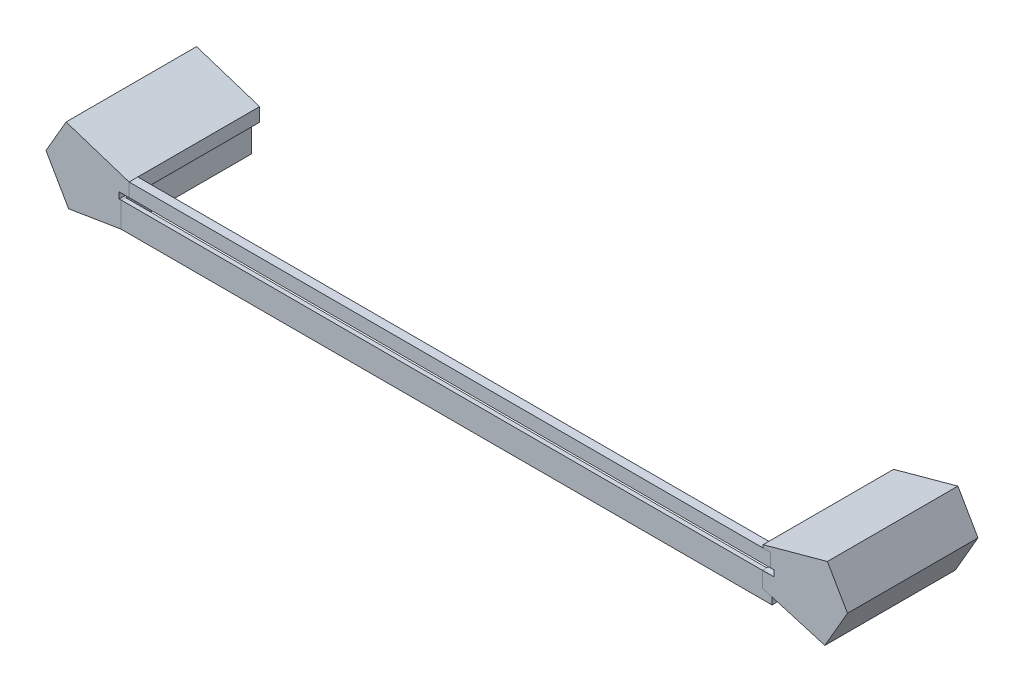
ISO-10303-21;
HEADER;
FILE_DESCRIPTION(('STEP AP214'),'2;1');
FILE_NAME('part.step','',(''),(''),'','','');
FILE_SCHEMA(('AUTOMOTIVE_DESIGN { 1 0 10303 214 1 1 1 1 }'));
ENDSEC;
DATA;
#1=APPLICATION_CONTEXT('core data for automotive mechanical design processes');
#2=APPLICATION_PROTOCOL_DEFINITION('international standard','automotive_design',2000,#1);
#3=PRODUCT_CONTEXT('',#1,'mechanical');
#4=PRODUCT('Part','Part','',(#3));
#5=PRODUCT_RELATED_PRODUCT_CATEGORY('part','',(#4));
#6=PRODUCT_DEFINITION_FORMATION('','',#4);
#7=PRODUCT_DEFINITION_CONTEXT('part definition',#1,'design');
#8=PRODUCT_DEFINITION('design','',#6,#7);
#9=PRODUCT_DEFINITION_SHAPE('','',#8);
#10=(LENGTH_UNIT() NAMED_UNIT(*) SI_UNIT(.MILLI.,.METRE.));
#11=(NAMED_UNIT(*) PLANE_ANGLE_UNIT() SI_UNIT($,.RADIAN.));
#12=(NAMED_UNIT(*) SI_UNIT($,.STERADIAN.) SOLID_ANGLE_UNIT());
#13=UNCERTAINTY_MEASURE_WITH_UNIT(LENGTH_MEASURE(1.E-05),#10,'distance_accuracy_value','');
#14=(GEOMETRIC_REPRESENTATION_CONTEXT(3) GLOBAL_UNCERTAINTY_ASSIGNED_CONTEXT((#13)) GLOBAL_UNIT_ASSIGNED_CONTEXT((#10,
#11,#12)) REPRESENTATION_CONTEXT('',''));
#15=CARTESIAN_POINT('',(0.,0.,0.));
#16=DIRECTION('',(0.,0.,1.));
#17=DIRECTION('',(1.,0.,0.));
#18=AXIS2_PLACEMENT_3D('',#15,#16,#17);
#19=CARTESIAN_POINT('',(-74.8408533128003,-1.22628229589977,29.));
#20=DIRECTION('',(-1.,0.,0.));
#21=DIRECTION('',(0.,-1.,0.));
#22=AXIS2_PLACEMENT_3D('',#19,#20,#21);
#23=PLANE('',#22);
#24=DIRECTION('',(0.,-1.,0.));
#25=VECTOR('',#24,1.);
#26=CARTESIAN_POINT('',(-74.8408533128003,-1.22628229589977,30.));
#27=LINE('',#26,#25);
#28=CARTESIAN_POINT('',(-74.8408533128003,-1.22628229589977,30.));
#29=VERTEX_POINT('',#28);
#30=CARTESIAN_POINT('',(-74.8408533128002,-7.02496915296607,30.));
#31=VERTEX_POINT('',#30);
#32=EDGE_CURVE('E108',#29,#31,#27,.T.);
#33=ORIENTED_EDGE('',*,*,#32,.F.);
#34=DIRECTION('',(0.,0.,1.));
#35=VECTOR('',#34,1.);
#36=CARTESIAN_POINT('',(-74.8408533128003,-1.22628229589977,29.));
#37=LINE('',#36,#35);
#38=CARTESIAN_POINT('',(-74.8408533128003,-1.22628229589977,29.));
#39=VERTEX_POINT('',#38);
#40=EDGE_CURVE('E12',#39,#29,#37,.T.);
#41=ORIENTED_EDGE('',*,*,#40,.F.);
#42=DIRECTION('',(0.,-1.,0.));
#43=VECTOR('',#42,1.);
#44=CARTESIAN_POINT('',(-74.8408533128003,-1.22628229589977,29.));
#45=LINE('',#44,#43);
#46=CARTESIAN_POINT('',(-74.8408533128002,-7.02496915296607,29.));
#47=VERTEX_POINT('',#46);
#48=EDGE_CURVE('E102',#39,#47,#45,.T.);
#49=ORIENTED_EDGE('',*,*,#48,.T.);
#50=DIRECTION('',(0.,0.,1.));
#51=VECTOR('',#50,1.);
#52=CARTESIAN_POINT('',(-74.8408533128002,-7.02496915296607,29.));
#53=LINE('',#52,#51);
#54=EDGE_CURVE('E47',#47,#31,#53,.T.);
#55=ORIENTED_EDGE('',*,*,#54,.T.);
#56=EDGE_LOOP('',(#33,#41,#49,#55));
#57=FACE_BOUND('',#56,.T.);
#58=ADVANCED_FACE('F44',(#57),#23,.T.);
#59=CARTESIAN_POINT('',(-74.8408533128003,-1.22628229589977,29.));
#60=DIRECTION('',(0.,1.,0.));
#61=DIRECTION('',(0.,0.,1.));
#62=AXIS2_PLACEMENT_3D('',#59,#60,#61);
#63=PLANE('',#62);
#64=DIRECTION('',(-1.,0.,0.));
#65=VECTOR('',#64,1.);
#66=CARTESIAN_POINT('',(-74.8408533128003,-1.22628229589977,30.));
#67=LINE('',#66,#65);
#68=CARTESIAN_POINT('',(74.7709871290302,-1.22628229589977,30.));
#69=VERTEX_POINT('',#68);
#70=EDGE_CURVE('E104',#69,#29,#67,.T.);
#71=ORIENTED_EDGE('',*,*,#70,.F.);
#72=DIRECTION('',(0.,0.,1.));
#73=VECTOR('',#72,1.);
#74=CARTESIAN_POINT('',(74.7709871290302,-1.22628229589977,29.));
#75=LINE('',#74,#73);
#76=CARTESIAN_POINT('',(74.7709871290302,-1.22628229589977,29.));
#77=VERTEX_POINT('',#76);
#78=EDGE_CURVE('E53',#77,#69,#75,.T.);
#79=ORIENTED_EDGE('',*,*,#78,.F.);
#80=DIRECTION('',(-1.,0.,0.));
#81=VECTOR('',#80,1.);
#82=CARTESIAN_POINT('',(-74.8408533128003,-1.22628229589977,29.));
#83=LINE('',#82,#81);
#84=EDGE_CURVE('E99',#77,#39,#83,.T.);
#85=ORIENTED_EDGE('',*,*,#84,.T.);
#86=ORIENTED_EDGE('',*,*,#40,.T.);
#87=EDGE_LOOP('',(#71,#79,#85,#86));
#88=FACE_BOUND('',#87,.T.);
#89=ADVANCED_FACE('F118',(#88),#63,.T.);
#90=CARTESIAN_POINT('',(74.7709871290302,-1.22628229589977,29.));
#91=DIRECTION('',(1.,0.,0.));
#92=DIRECTION('',(0.,0.,-1.));
#93=AXIS2_PLACEMENT_3D('',#90,#91,#92);
#94=PLANE('',#93);
#95=DIRECTION('',(0.,1.,0.));
#96=VECTOR('',#95,1.);
#97=CARTESIAN_POINT('',(74.7709871290302,-1.22628229589977,30.));
#98=LINE('',#97,#96);
#99=CARTESIAN_POINT('',(74.7709871290302,-7.02496915296607,30.));
#100=VERTEX_POINT('',#99);
#101=EDGE_CURVE('E94',#100,#69,#98,.T.);
#102=ORIENTED_EDGE('',*,*,#101,.F.);
#103=DIRECTION('',(0.,0.,1.));
#104=VECTOR('',#103,1.);
#105=CARTESIAN_POINT('',(74.7709871290302,-7.02496915296607,29.));
#106=LINE('',#105,#104);
#107=CARTESIAN_POINT('',(74.7709871290302,-7.02496915296607,29.));
#108=VERTEX_POINT('',#107);
#109=EDGE_CURVE('E89',#108,#100,#106,.T.);
#110=ORIENTED_EDGE('',*,*,#109,.F.);
#111=DIRECTION('',(0.,1.,0.));
#112=VECTOR('',#111,1.);
#113=CARTESIAN_POINT('',(74.7709871290302,-1.22628229589977,29.));
#114=LINE('',#113,#112);
#115=EDGE_CURVE('E92',#108,#77,#114,.T.);
#116=ORIENTED_EDGE('',*,*,#115,.T.);
#117=ORIENTED_EDGE('',*,*,#78,.T.);
#118=EDGE_LOOP('',(#102,#110,#116,#117));
#119=FACE_BOUND('',#118,.T.);
#120=ADVANCED_FACE('F91',(#119),#94,.T.);
#121=CARTESIAN_POINT('',(-74.8408533128002,-7.02496915296607,29.));
#122=DIRECTION('',(0.,-1.,0.));
#123=DIRECTION('',(0.,0.,-1.));
#124=AXIS2_PLACEMENT_3D('',#121,#122,#123);
#125=PLANE('',#124);
#126=DIRECTION('',(1.,0.,0.));
#127=VECTOR('',#126,1.);
#128=CARTESIAN_POINT('',(-74.8408533128002,-7.02496915296607,30.));
#129=LINE('',#128,#127);
#130=EDGE_CURVE('E111',#31,#100,#129,.T.);
#131=ORIENTED_EDGE('',*,*,#130,.F.);
#132=ORIENTED_EDGE('',*,*,#54,.F.);
#133=DIRECTION('',(1.,0.,0.));
#134=VECTOR('',#133,1.);
#135=CARTESIAN_POINT('',(-74.8408533128002,-7.02496915296607,29.));
#136=LINE('',#135,#134);
#137=EDGE_CURVE('E98',#47,#108,#136,.T.);
#138=ORIENTED_EDGE('',*,*,#137,.T.);
#139=ORIENTED_EDGE('',*,*,#109,.T.);
#140=EDGE_LOOP('',(#131,#132,#138,#139));
#141=FACE_BOUND('',#140,.T.);
#142=ADVANCED_FACE('F101',(#141),#125,.T.);
#143=CARTESIAN_POINT('',(0.,0.,29.));
#144=DIRECTION('',(0.,0.,1.));
#145=DIRECTION('',(1.,0.,0.));
#146=AXIS2_PLACEMENT_3D('',#143,#144,#145);
#147=PLANE('',#146);
#148=ORIENTED_EDGE('',*,*,#48,.F.);
#149=ORIENTED_EDGE('',*,*,#84,.F.);
#150=ORIENTED_EDGE('',*,*,#115,.F.);
#151=ORIENTED_EDGE('',*,*,#137,.F.);
#152=EDGE_LOOP('',(#148,#149,#150,#151));
#153=FACE_BOUND('',#152,.T.);
#154=ADVANCED_FACE('F97',(#153),#147,.F.);
#155=CARTESIAN_POINT('',(0.,0.,30.));
#156=DIRECTION('',(0.,0.,1.));
#157=DIRECTION('',(1.,0.,0.));
#158=AXIS2_PLACEMENT_3D('',#155,#156,#157);
#159=PLANE('',#158);
#160=ORIENTED_EDGE('',*,*,#32,.T.);
#161=ORIENTED_EDGE('',*,*,#130,.T.);
#162=ORIENTED_EDGE('',*,*,#101,.T.);
#163=ORIENTED_EDGE('',*,*,#70,.T.);
#164=EDGE_LOOP('',(#160,#161,#162,#163));
#165=FACE_BOUND('',#164,.T.);
#166=ADVANCED_FACE('F117',(#165),#159,.T.);
#167=CLOSED_SHELL('',(#58,#89,#120,#142,#154,#166));
#168=MANIFOLD_SOLID_BREP('B2',#167);
#169=CARTESIAN_POINT('',(-73.0150408186881,3.28865264531398,28.));
#170=DIRECTION('',(-1.,0.,0.));
#171=DIRECTION('',(0.,0.,1.));
#172=AXIS2_PLACEMENT_3D('',#169,#170,#171);
#173=PLANE('',#172);
#174=DIRECTION('',(0.,-1.,0.));
#175=VECTOR('',#174,1.);
#176=CARTESIAN_POINT('',(-73.0150408186881,3.28865264531398,30.));
#177=LINE('',#176,#175);
#178=CARTESIAN_POINT('',(-73.0150408186881,3.28865264531398,30.));
#179=VERTEX_POINT('',#178);
#180=CARTESIAN_POINT('',(-73.0150408186881,0.175942656284918,30.));
#181=VERTEX_POINT('',#180);
#182=EDGE_CURVE('E242',#179,#181,#177,.T.);
#183=ORIENTED_EDGE('',*,*,#182,.F.);
#184=DIRECTION('',(0.,0.,1.));
#185=VECTOR('',#184,1.);
#186=CARTESIAN_POINT('',(-73.0150408186881,3.28865264531398,28.));
#187=LINE('',#186,#185);
#188=CARTESIAN_POINT('',(-73.0150408186881,3.28865264531398,28.));
#189=VERTEX_POINT('',#188);
#190=EDGE_CURVE('E42',#189,#179,#187,.T.);
#191=ORIENTED_EDGE('',*,*,#190,.F.);
#192=DIRECTION('',(0.,-1.,0.));
#193=VECTOR('',#192,1.);
#194=CARTESIAN_POINT('',(-73.0150408186881,3.28865264531398,28.));
#195=LINE('',#194,#193);
#196=CARTESIAN_POINT('',(-73.0150408186881,0.175942656284918,28.));
#197=VERTEX_POINT('',#196);
#198=EDGE_CURVE('E236',#189,#197,#195,.T.);
#199=ORIENTED_EDGE('',*,*,#198,.T.);
#200=DIRECTION('',(0.,0.,1.));
#201=VECTOR('',#200,1.);
#202=CARTESIAN_POINT('',(-73.0150408186881,0.175942656284918,28.));
#203=LINE('',#202,#201);
#204=EDGE_CURVE('E181',#197,#181,#203,.T.);
#205=ORIENTED_EDGE('',*,*,#204,.T.);
#206=EDGE_LOOP('',(#183,#191,#199,#205));
#207=FACE_BOUND('',#206,.T.);
#208=ADVANCED_FACE('F178',(#207),#173,.T.);
#209=CARTESIAN_POINT('',(74.4294841581397,3.288652645314,28.));
#210=DIRECTION('',(0.,1.,0.));
#211=DIRECTION('',(-1.,0.,0.));
#212=AXIS2_PLACEMENT_3D('',#209,#210,#211);
#213=PLANE('',#212);
#214=DIRECTION('',(-1.,0.,0.));
#215=VECTOR('',#214,1.);
#216=CARTESIAN_POINT('',(74.4294841581397,3.288652645314,30.));
#217=LINE('',#216,#215);
#218=CARTESIAN_POINT('',(74.4294841581397,3.288652645314,30.));
#219=VERTEX_POINT('',#218);
#220=EDGE_CURVE('E238',#219,#179,#217,.T.);
#221=ORIENTED_EDGE('',*,*,#220,.F.);
#222=DIRECTION('',(0.,0.,1.));
#223=VECTOR('',#222,1.);
#224=CARTESIAN_POINT('',(74.4294841581397,3.288652645314,28.));
#225=LINE('',#224,#223);
#226=CARTESIAN_POINT('',(74.4294841581397,3.288652645314,28.));
#227=VERTEX_POINT('',#226);
#228=EDGE_CURVE('E187',#227,#219,#225,.T.);
#229=ORIENTED_EDGE('',*,*,#228,.F.);
#230=DIRECTION('',(-1.,0.,0.));
#231=VECTOR('',#230,1.);
#232=CARTESIAN_POINT('',(74.4294841581397,3.288652645314,28.));
#233=LINE('',#232,#231);
#234=EDGE_CURVE('E233',#227,#189,#233,.T.);
#235=ORIENTED_EDGE('',*,*,#234,.T.);
#236=ORIENTED_EDGE('',*,*,#190,.T.);
#237=EDGE_LOOP('',(#221,#229,#235,#236));
#238=FACE_BOUND('',#237,.T.);
#239=ADVANCED_FACE('F252',(#238),#213,.T.);
#240=CARTESIAN_POINT('',(74.4294841581397,0.175942656284918,28.));
#241=DIRECTION('',(1.,0.,0.));
#242=DIRECTION('',(0.,0.,-1.));
#243=AXIS2_PLACEMENT_3D('',#240,#241,#242);
#244=PLANE('',#243);
#245=DIRECTION('',(0.,1.,0.));
#246=VECTOR('',#245,1.);
#247=CARTESIAN_POINT('',(74.4294841581397,0.175942656284918,30.));
#248=LINE('',#247,#246);
#249=CARTESIAN_POINT('',(74.4294841581397,0.175942656284918,30.));
#250=VERTEX_POINT('',#249);
#251=EDGE_CURVE('E228',#250,#219,#248,.T.);
#252=ORIENTED_EDGE('',*,*,#251,.F.);
#253=DIRECTION('',(0.,0.,1.));
#254=VECTOR('',#253,1.);
#255=CARTESIAN_POINT('',(74.4294841581397,0.175942656284918,28.));
#256=LINE('',#255,#254);
#257=CARTESIAN_POINT('',(74.4294841581397,0.175942656284918,28.));
#258=VERTEX_POINT('',#257);
#259=EDGE_CURVE('E223',#258,#250,#256,.T.);
#260=ORIENTED_EDGE('',*,*,#259,.F.);
#261=DIRECTION('',(0.,1.,0.));
#262=VECTOR('',#261,1.);
#263=CARTESIAN_POINT('',(74.4294841581397,0.175942656284918,28.));
#264=LINE('',#263,#262);
#265=EDGE_CURVE('E226',#258,#227,#264,.T.);
#266=ORIENTED_EDGE('',*,*,#265,.T.);
#267=ORIENTED_EDGE('',*,*,#228,.T.);
#268=EDGE_LOOP('',(#252,#260,#266,#267));
#269=FACE_BOUND('',#268,.T.);
#270=ADVANCED_FACE('F225',(#269),#244,.T.);
#271=CARTESIAN_POINT('',(-73.0150408186881,0.175942656284918,28.));
#272=DIRECTION('',(0.,-1.,0.));
#273=DIRECTION('',(0.,0.,-1.));
#274=AXIS2_PLACEMENT_3D('',#271,#272,#273);
#275=PLANE('',#274);
#276=DIRECTION('',(1.,0.,0.));
#277=VECTOR('',#276,1.);
#278=CARTESIAN_POINT('',(-73.0150408186881,0.175942656284918,30.));
#279=LINE('',#278,#277);
#280=EDGE_CURVE('E245',#181,#250,#279,.T.);
#281=ORIENTED_EDGE('',*,*,#280,.F.);
#282=ORIENTED_EDGE('',*,*,#204,.F.);
#283=DIRECTION('',(1.,0.,0.));
#284=VECTOR('',#283,1.);
#285=CARTESIAN_POINT('',(-73.0150408186881,0.175942656284918,28.));
#286=LINE('',#285,#284);
#287=EDGE_CURVE('E232',#197,#258,#286,.T.);
#288=ORIENTED_EDGE('',*,*,#287,.T.);
#289=ORIENTED_EDGE('',*,*,#259,.T.);
#290=EDGE_LOOP('',(#281,#282,#288,#289));
#291=FACE_BOUND('',#290,.T.);
#292=ADVANCED_FACE('F235',(#291),#275,.T.);
#293=CARTESIAN_POINT('',(0.,0.,28.));
#294=DIRECTION('',(0.,0.,1.));
#295=DIRECTION('',(1.,0.,0.));
#296=AXIS2_PLACEMENT_3D('',#293,#294,#295);
#297=PLANE('',#296);
#298=ORIENTED_EDGE('',*,*,#198,.F.);
#299=ORIENTED_EDGE('',*,*,#234,.F.);
#300=ORIENTED_EDGE('',*,*,#265,.F.);
#301=ORIENTED_EDGE('',*,*,#287,.F.);
#302=EDGE_LOOP('',(#298,#299,#300,#301));
#303=FACE_BOUND('',#302,.T.);
#304=ADVANCED_FACE('F231',(#303),#297,.F.);
#305=CARTESIAN_POINT('',(0.,0.,30.));
#306=DIRECTION('',(0.,0.,1.));
#307=DIRECTION('',(1.,0.,0.));
#308=AXIS2_PLACEMENT_3D('',#305,#306,#307);
#309=PLANE('',#308);
#310=ORIENTED_EDGE('',*,*,#182,.T.);
#311=ORIENTED_EDGE('',*,*,#280,.T.);
#312=ORIENTED_EDGE('',*,*,#251,.T.);
#313=ORIENTED_EDGE('',*,*,#220,.T.);
#314=EDGE_LOOP('',(#310,#311,#312,#313));
#315=FACE_BOUND('',#314,.T.);
#316=ADVANCED_FACE('F251',(#315),#309,.T.);
#317=CLOSED_SHELL('',(#208,#239,#270,#292,#304,#316));
#318=MANIFOLD_SOLID_BREP('B6',#317);
#319=CARTESIAN_POINT('',(86.9138475772934,-9.,30.));
#320=DIRECTION('',(-0.866025403784442,0.499999999999994,0.));
#321=DIRECTION('',(-0.499999999999994,-0.866025403784442,0.));
#322=AXIS2_PLACEMENT_3D('',#319,#320,#321);
#323=PLANE('',#322);
#324=DIRECTION('',(0.499999999999994,0.866025403784442,0.));
#325=VECTOR('',#324,1.);
#326=CARTESIAN_POINT('',(86.9138475772934,-9.,0.));
#327=LINE('',#326,#325);
#328=CARTESIAN_POINT('',(86.9138475772934,-9.,0.));
#329=VERTEX_POINT('',#328);
#330=CARTESIAN_POINT('',(92.11,0.,0.));
#331=VERTEX_POINT('',#330);
#332=EDGE_CURVE('E413',#329,#331,#327,.T.);
#333=ORIENTED_EDGE('',*,*,#332,.T.);
#334=DIRECTION('',(0.,0.,-1.));
#335=VECTOR('',#334,1.);
#336=CARTESIAN_POINT('',(92.11,0.,30.));
#337=LINE('',#336,#335);
#338=CARTESIAN_POINT('',(92.11,0.,30.));
#339=VERTEX_POINT('',#338);
#340=EDGE_CURVE('E176',#339,#331,#337,.T.);
#341=ORIENTED_EDGE('',*,*,#340,.F.);
#342=DIRECTION('',(0.499999999999994,0.866025403784442,0.));
#343=VECTOR('',#342,1.);
#344=CARTESIAN_POINT('',(86.9138475772934,-9.,30.));
#345=LINE('',#344,#343);
#346=CARTESIAN_POINT('',(86.9138475772934,-9.,30.));
#347=VERTEX_POINT('',#346);
#348=EDGE_CURVE('E429',#347,#339,#345,.T.);
#349=ORIENTED_EDGE('',*,*,#348,.F.);
#350=DIRECTION('',(0.,0.,-1.));
#351=VECTOR('',#350,1.);
#352=CARTESIAN_POINT('',(86.9138475772934,-9.,30.));
#353=LINE('',#352,#351);
#354=EDGE_CURVE('E409',#347,#329,#353,.T.);
#355=ORIENTED_EDGE('',*,*,#354,.T.);
#356=EDGE_LOOP('',(#333,#341,#349,#355));
#357=FACE_BOUND('',#356,.T.);
#358=ADVANCED_FACE('F311',(#357),#323,.F.);
#359=CARTESIAN_POINT('',(92.11,0.,30.));
#360=DIRECTION('',(-0.866025403784435,-0.500000000000006,0.));
#361=DIRECTION('',(0.500000000000006,-0.866025403784435,0.));
#362=AXIS2_PLACEMENT_3D('',#359,#360,#361);
#363=PLANE('',#362);
#364=DIRECTION('',(-0.500000000000006,0.866025403784435,0.));
#365=VECTOR('',#364,1.);
#366=CARTESIAN_POINT('',(92.11,0.,0.));
#367=LINE('',#366,#365);
#368=CARTESIAN_POINT('',(87.4911978464829,8.,0.));
#369=VERTEX_POINT('',#368);
#370=EDGE_CURVE('E416',#331,#369,#367,.T.);
#371=ORIENTED_EDGE('',*,*,#370,.T.);
#372=DIRECTION('',(0.,0.,-1.));
#373=VECTOR('',#372,1.);
#374=CARTESIAN_POINT('',(87.4911978464829,8.,30.));
#375=LINE('',#374,#373);
#376=CARTESIAN_POINT('',(87.4911978464829,8.,30.));
#377=VERTEX_POINT('',#376);
#378=EDGE_CURVE('E319',#377,#369,#375,.T.);
#379=ORIENTED_EDGE('',*,*,#378,.F.);
#380=DIRECTION('',(-0.500000000000006,0.866025403784435,0.));
#381=VECTOR('',#380,1.);
#382=CARTESIAN_POINT('',(92.11,0.,30.));
#383=LINE('',#382,#381);
#384=EDGE_CURVE('E373',#339,#377,#383,.T.);
#385=ORIENTED_EDGE('',*,*,#384,.F.);
#386=ORIENTED_EDGE('',*,*,#340,.T.);
#387=EDGE_LOOP('',(#371,#379,#385,#386));
#388=FACE_BOUND('',#387,.T.);
#389=ADVANCED_FACE('F472',(#388),#363,.F.);
#390=CARTESIAN_POINT('',(87.4911978464829,8.,30.));
#391=DIRECTION('',(0.264003025865213,-0.964521851662269,0.));
#392=DIRECTION('',(0.964521851662269,0.264003025865213,0.));
#393=AXIS2_PLACEMENT_3D('',#390,#391,#392);
#394=PLANE('',#393);
#395=DIRECTION('',(-0.964521851662269,-0.264003025865213,0.));
#396=VECTOR('',#395,1.);
#397=CARTESIAN_POINT('',(87.4911978464829,8.,0.));
#398=LINE('',#397,#396);
#399=CARTESIAN_POINT('',(72.7082274002854,3.95369568626557,0.));
#400=VERTEX_POINT('',#399);
#401=EDGE_CURVE('E418',#369,#400,#398,.T.);
#402=ORIENTED_EDGE('',*,*,#401,.T.);
#403=DIRECTION('',(0.,0.,-1.));
#404=VECTOR('',#403,1.);
#405=CARTESIAN_POINT('',(72.7082274002854,3.95369568626557,30.));
#406=LINE('',#405,#404);
#407=CARTESIAN_POINT('',(72.7082274002854,3.95369568626557,30.));
#408=VERTEX_POINT('',#407);
#409=EDGE_CURVE('E439',#408,#400,#406,.T.);
#410=ORIENTED_EDGE('',*,*,#409,.F.);
#411=DIRECTION('',(-0.964521851662269,-0.264003025865213,0.));
#412=VECTOR('',#411,1.);
#413=CARTESIAN_POINT('',(87.4911978464829,8.,30.));
#414=LINE('',#413,#412);
#415=EDGE_CURVE('E447',#377,#408,#414,.T.);
#416=ORIENTED_EDGE('',*,*,#415,.F.);
#417=ORIENTED_EDGE('',*,*,#378,.T.);
#418=EDGE_LOOP('',(#402,#410,#416,#417));
#419=FACE_BOUND('',#418,.T.);
#420=ADVANCED_FACE('F445',(#419),#394,.F.);
#421=CARTESIAN_POINT('',(72.7082274002854,3.95369568626557,30.));
#422=DIRECTION('',(1.,0.,0.));
#423=DIRECTION('',(0.,1.,0.));
#424=AXIS2_PLACEMENT_3D('',#421,#422,#423);
#425=PLANE('',#424);
#426=DIRECTION('',(0.,-1.,0.));
#427=VECTOR('',#426,1.);
#428=CARTESIAN_POINT('',(72.7082274002854,3.95369568626557,0.));
#429=LINE('',#428,#427);
#430=CARTESIAN_POINT('',(72.7082274002854,0.208287178889409,0.));
#431=VERTEX_POINT('',#430);
#432=EDGE_CURVE('E420',#400,#431,#429,.T.);
#433=ORIENTED_EDGE('',*,*,#432,.T.);
#434=DIRECTION('',(0.,0.,-1.));
#435=VECTOR('',#434,1.);
#436=CARTESIAN_POINT('',(72.7082274002854,0.208287178889409,30.));
#437=LINE('',#436,#435);
#438=CARTESIAN_POINT('',(72.7082274002854,0.208287178889409,30.));
#439=VERTEX_POINT('',#438);
#440=EDGE_CURVE('E436',#439,#431,#437,.T.);
#441=ORIENTED_EDGE('',*,*,#440,.F.);
#442=DIRECTION('',(0.,-1.,0.));
#443=VECTOR('',#442,1.);
#444=CARTESIAN_POINT('',(72.7082274002854,3.95369568626557,30.));
#445=LINE('',#444,#443);
#446=EDGE_CURVE('E463',#408,#439,#445,.T.);
#447=ORIENTED_EDGE('',*,*,#446,.F.);
#448=ORIENTED_EDGE('',*,*,#409,.T.);
#449=EDGE_LOOP('',(#433,#441,#447,#448));
#450=FACE_BOUND('',#449,.T.);
#451=ADVANCED_FACE('F456',(#450),#425,.F.);
#452=CARTESIAN_POINT('',(72.7082274002854,0.208287178889409,30.));
#453=DIRECTION('',(0.,1.,0.));
#454=DIRECTION('',(-1.,0.,0.));
#455=AXIS2_PLACEMENT_3D('',#452,#453,#454);
#456=PLANE('',#455);
#457=DIRECTION('',(1.,0.,0.));
#458=VECTOR('',#457,1.);
#459=CARTESIAN_POINT('',(72.7082274002854,0.208287178889409,0.));
#460=LINE('',#459,#458);
#461=CARTESIAN_POINT('',(75.276894,0.208287178889409,0.));
#462=VERTEX_POINT('',#461);
#463=EDGE_CURVE('E422',#431,#462,#460,.T.);
#464=ORIENTED_EDGE('',*,*,#463,.T.);
#465=DIRECTION('',(0.,0.,-1.));
#466=VECTOR('',#465,1.);
#467=CARTESIAN_POINT('',(75.276894,0.208287178889409,30.));
#468=LINE('',#467,#466);
#469=CARTESIAN_POINT('',(75.276894,0.208287178889409,30.));
#470=VERTEX_POINT('',#469);
#471=EDGE_CURVE('E433',#470,#462,#468,.T.);
#472=ORIENTED_EDGE('',*,*,#471,.F.);
#473=DIRECTION('',(1.,0.,0.));
#474=VECTOR('',#473,1.);
#475=CARTESIAN_POINT('',(72.7082274002854,0.208287178889409,30.));
#476=LINE('',#475,#474);
#477=EDGE_CURVE('E462',#439,#470,#476,.T.);
#478=ORIENTED_EDGE('',*,*,#477,.F.);
#479=ORIENTED_EDGE('',*,*,#440,.T.);
#480=EDGE_LOOP('',(#464,#472,#478,#479));
#481=FACE_BOUND('',#480,.T.);
#482=ADVANCED_FACE('F460',(#481),#456,.F.);
#483=CARTESIAN_POINT('',(75.276894,0.208287178889409,30.));
#484=DIRECTION('',(1.,0.,0.));
#485=DIRECTION('',(0.,0.,-1.));
#486=AXIS2_PLACEMENT_3D('',#483,#484,#485);
#487=PLANE('',#486);
#488=DIRECTION('',(0.,-1.,0.));
#489=VECTOR('',#488,1.);
#490=CARTESIAN_POINT('',(75.276894,0.208287178889409,0.));
#491=LINE('',#490,#489);
#492=CARTESIAN_POINT('',(75.276894,-1.19171282111059,0.));
#493=VERTEX_POINT('',#492);
#494=EDGE_CURVE('E424',#462,#493,#491,.T.);
#495=ORIENTED_EDGE('',*,*,#494,.T.);
#496=DIRECTION('',(0.,0.,-1.));
#497=VECTOR('',#496,1.);
#498=CARTESIAN_POINT('',(75.276894,-1.19171282111059,30.));
#499=LINE('',#498,#497);
#500=CARTESIAN_POINT('',(75.276894,-1.19171282111059,30.));
#501=VERTEX_POINT('',#500);
#502=EDGE_CURVE('E404',#501,#493,#499,.T.);
#503=ORIENTED_EDGE('',*,*,#502,.F.);
#504=DIRECTION('',(0.,-1.,0.));
#505=VECTOR('',#504,1.);
#506=CARTESIAN_POINT('',(75.276894,0.208287178889409,30.));
#507=LINE('',#506,#505);
#508=EDGE_CURVE('E395',#470,#501,#507,.T.);
#509=ORIENTED_EDGE('',*,*,#508,.F.);
#510=ORIENTED_EDGE('',*,*,#471,.T.);
#511=EDGE_LOOP('',(#495,#503,#509,#510));
#512=FACE_BOUND('',#511,.T.);
#513=ADVANCED_FACE('F484',(#512),#487,.F.);
#514=CARTESIAN_POINT('',(75.276894,-1.19171282111059,30.));
#515=DIRECTION('',(0.,-1.,0.));
#516=DIRECTION('',(1.,0.,0.));
#517=AXIS2_PLACEMENT_3D('',#514,#515,#516);
#518=PLANE('',#517);
#519=DIRECTION('',(-1.,0.,0.));
#520=VECTOR('',#519,1.);
#521=CARTESIAN_POINT('',(75.276894,-1.19171282111059,0.));
#522=LINE('',#521,#520);
#523=CARTESIAN_POINT('',(72.5620525819055,-1.19171282111059,0.));
#524=VERTEX_POINT('',#523);
#525=EDGE_CURVE('E403',#493,#524,#522,.T.);
#526=ORIENTED_EDGE('',*,*,#525,.T.);
#527=DIRECTION('',(0.,0.,-1.));
#528=VECTOR('',#527,1.);
#529=CARTESIAN_POINT('',(72.5620525819055,-1.19171282111059,30.));
#530=LINE('',#529,#528);
#531=CARTESIAN_POINT('',(72.5620525819055,-1.19171282111059,30.));
#532=VERTEX_POINT('',#531);
#533=EDGE_CURVE('E400',#532,#524,#530,.T.);
#534=ORIENTED_EDGE('',*,*,#533,.F.);
#535=DIRECTION('',(-1.,0.,0.));
#536=VECTOR('',#535,1.);
#537=CARTESIAN_POINT('',(75.276894,-1.19171282111059,30.));
#538=LINE('',#537,#536);
#539=EDGE_CURVE('E389',#501,#532,#538,.T.);
#540=ORIENTED_EDGE('',*,*,#539,.F.);
#541=ORIENTED_EDGE('',*,*,#502,.T.);
#542=EDGE_LOOP('',(#526,#534,#540,#541));
#543=FACE_BOUND('',#542,.T.);
#544=ADVANCED_FACE('F401',(#543),#518,.F.);
#545=CARTESIAN_POINT('',(72.5620525819055,-1.19171282111059,30.));
#546=DIRECTION('',(1.,0.,0.));
#547=DIRECTION('',(0.,1.,0.));
#548=AXIS2_PLACEMENT_3D('',#545,#546,#547);
#549=PLANE('',#548);
#550=DIRECTION('',(0.,-1.,0.));
#551=VECTOR('',#550,1.);
#552=CARTESIAN_POINT('',(72.5620525819055,-1.19171282111059,0.));
#553=LINE('',#552,#551);
#554=CARTESIAN_POINT('',(72.5620525819054,-4.78940720845128,0.));
#555=VERTEX_POINT('',#554);
#556=EDGE_CURVE('E359',#524,#555,#553,.T.);
#557=ORIENTED_EDGE('',*,*,#556,.T.);
#558=DIRECTION('',(0.,0.,-1.));
#559=VECTOR('',#558,1.);
#560=CARTESIAN_POINT('',(72.5620525819054,-4.78940720845128,30.));
#561=LINE('',#560,#559);
#562=CARTESIAN_POINT('',(72.5620525819054,-4.78940720845128,30.));
#563=VERTEX_POINT('',#562);
#564=EDGE_CURVE('E405',#563,#555,#561,.T.);
#565=ORIENTED_EDGE('',*,*,#564,.F.);
#566=DIRECTION('',(0.,-1.,0.));
#567=VECTOR('',#566,1.);
#568=CARTESIAN_POINT('',(72.5620525819055,-1.19171282111059,30.));
#569=LINE('',#568,#567);
#570=EDGE_CURVE('E393',#532,#563,#569,.T.);
#571=ORIENTED_EDGE('',*,*,#570,.F.);
#572=ORIENTED_EDGE('',*,*,#533,.T.);
#573=EDGE_LOOP('',(#557,#565,#571,#572));
#574=FACE_BOUND('',#573,.T.);
#575=ADVANCED_FACE('F407',(#574),#549,.F.);
#576=CARTESIAN_POINT('',(72.5620525819054,-4.78940720845128,30.));
#577=DIRECTION('',(0.281518688425587,0.959555745158736,0.));
#578=DIRECTION('',(-0.959555745158736,0.281518688425587,0.));
#579=AXIS2_PLACEMENT_3D('',#576,#577,#578);
#580=PLANE('',#579);
#581=DIRECTION('',(0.959555745158736,-0.281518688425587,0.));
#582=VECTOR('',#581,1.);
#583=CARTESIAN_POINT('',(72.5620525819054,-4.78940720845128,0.));
#584=LINE('',#583,#582);
#585=EDGE_CURVE('E365',#555,#329,#584,.T.);
#586=ORIENTED_EDGE('',*,*,#585,.T.);
#587=ORIENTED_EDGE('',*,*,#354,.F.);
#588=DIRECTION('',(0.959555745158736,-0.281518688425587,0.));
#589=VECTOR('',#588,1.);
#590=CARTESIAN_POINT('',(72.5620525819054,-4.78940720845128,30.));
#591=LINE('',#590,#589);
#592=EDGE_CURVE('E327',#563,#347,#591,.T.);
#593=ORIENTED_EDGE('',*,*,#592,.F.);
#594=ORIENTED_EDGE('',*,*,#564,.T.);
#595=EDGE_LOOP('',(#586,#587,#593,#594));
#596=FACE_BOUND('',#595,.T.);
#597=ADVANCED_FACE('F492',(#596),#580,.F.);
#598=CARTESIAN_POINT('',(0.,0.,30.));
#599=DIRECTION('',(0.,0.,-1.));
#600=DIRECTION('',(-1.,0.,0.));
#601=AXIS2_PLACEMENT_3D('',#598,#599,#600);
#602=PLANE('',#601);
#603=ORIENTED_EDGE('',*,*,#348,.T.);
#604=ORIENTED_EDGE('',*,*,#384,.T.);
#605=ORIENTED_EDGE('',*,*,#415,.T.);
#606=ORIENTED_EDGE('',*,*,#446,.T.);
#607=ORIENTED_EDGE('',*,*,#477,.T.);
#608=ORIENTED_EDGE('',*,*,#508,.T.);
#609=ORIENTED_EDGE('',*,*,#539,.T.);
#610=ORIENTED_EDGE('',*,*,#570,.T.);
#611=ORIENTED_EDGE('',*,*,#592,.T.);
#612=EDGE_LOOP('',(#603,#604,#605,#606,#607,#608,#609,#610,#611));
#613=FACE_BOUND('',#612,.T.);
#614=ADVANCED_FACE('F391',(#613),#602,.F.);
#615=CARTESIAN_POINT('',(0.,0.,0.));
#616=DIRECTION('',(0.,0.,-1.));
#617=DIRECTION('',(-1.,0.,0.));
#618=AXIS2_PLACEMENT_3D('',#615,#616,#617);
#619=PLANE('',#618);
#620=ORIENTED_EDGE('',*,*,#332,.F.);
#621=ORIENTED_EDGE('',*,*,#585,.F.);
#622=ORIENTED_EDGE('',*,*,#556,.F.);
#623=ORIENTED_EDGE('',*,*,#525,.F.);
#624=ORIENTED_EDGE('',*,*,#494,.F.);
#625=ORIENTED_EDGE('',*,*,#463,.F.);
#626=ORIENTED_EDGE('',*,*,#432,.F.);
#627=ORIENTED_EDGE('',*,*,#401,.F.);
#628=ORIENTED_EDGE('',*,*,#370,.F.);
#629=EDGE_LOOP('',(#620,#621,#622,#623,#624,#625,#626,#627,#628));
#630=FACE_BOUND('',#629,.T.);
#631=ADVANCED_FACE('F451',(#630),#619,.T.);
#632=CLOSED_SHELL('',(#358,#389,#420,#451,#482,#513,#544,#575,#597,#614,#631));
#633=MANIFOLD_SOLID_BREP('B36',#632);
#634=CARTESIAN_POINT('',(-75.2753867216399,-1.22681157521079,30.));
#635=DIRECTION('',(-0.999999258189438,-0.00121803964349211,0.));
#636=DIRECTION('',(0.00121803964349211,-0.999999258189438,0.));
#637=AXIS2_PLACEMENT_3D('',#634,#635,#636);
#638=PLANE('',#637);
#639=DIRECTION('',(-0.00121803964349211,0.999999258189438,0.));
#640=VECTOR('',#639,1.);
#641=CARTESIAN_POINT('',(-75.2753867216399,-1.22681157521079,0.));
#642=LINE('',#641,#640);
#643=CARTESIAN_POINT('',(-75.2753867216399,-1.22681157521079,0.));
#644=VERTEX_POINT('',#643);
#645=CARTESIAN_POINT('',(-75.2770919771408,0.173187386254428,0.));
#646=VERTEX_POINT('',#645);
#647=EDGE_CURVE('E667',#644,#646,#642,.T.);
#648=ORIENTED_EDGE('',*,*,#647,.T.);
#649=DIRECTION('',(0.,0.,-1.));
#650=VECTOR('',#649,1.);
#651=CARTESIAN_POINT('',(-75.2770919771408,0.173187386254428,30.));
#652=LINE('',#651,#650);
#653=CARTESIAN_POINT('',(-75.2770919771408,0.173187386254428,30.));
#654=VERTEX_POINT('',#653);
#655=EDGE_CURVE('E309',#654,#646,#652,.T.);
#656=ORIENTED_EDGE('',*,*,#655,.F.);
#657=DIRECTION('',(-0.00121803964349211,0.999999258189438,0.));
#658=VECTOR('',#657,1.);
#659=CARTESIAN_POINT('',(-75.2753867216399,-1.22681157521079,30.));
#660=LINE('',#659,#658);
#661=CARTESIAN_POINT('',(-75.2753867216399,-1.22681157521079,30.));
#662=VERTEX_POINT('',#661);
#663=EDGE_CURVE('E683',#662,#654,#660,.T.);
#664=ORIENTED_EDGE('',*,*,#663,.F.);
#665=DIRECTION('',(0.,0.,-1.));
#666=VECTOR('',#665,1.);
#667=CARTESIAN_POINT('',(-75.2753867216399,-1.22681157521079,30.));
#668=LINE('',#667,#666);
#669=EDGE_CURVE('E663',#662,#644,#668,.T.);
#670=ORIENTED_EDGE('',*,*,#669,.T.);
#671=EDGE_LOOP('',(#648,#656,#664,#670));
#672=FACE_BOUND('',#671,.T.);
#673=ADVANCED_FACE('F565',(#672),#638,.F.);
#674=CARTESIAN_POINT('',(-75.2770919771408,0.173187386254428,30.));
#675=DIRECTION('',(-0.00121803964349205,0.999999258189438,0.));
#676=DIRECTION('',(-0.999999258189438,-0.00121803964349205,0.));
#677=AXIS2_PLACEMENT_3D('',#674,#675,#676);
#678=PLANE('',#677);
#679=DIRECTION('',(0.999999258189438,0.00121803964349205,0.));
#680=VECTOR('',#679,1.);
#681=CARTESIAN_POINT('',(-75.2770919771408,0.173187386254428,0.));
#682=LINE('',#681,#680);
#683=CARTESIAN_POINT('',(-73.0150408186881,0.175942656284918,0.));
#684=VERTEX_POINT('',#683);
#685=EDGE_CURVE('E670',#646,#684,#682,.T.);
#686=ORIENTED_EDGE('',*,*,#685,.T.);
#687=DIRECTION('',(0.,0.,-1.));
#688=VECTOR('',#687,1.);
#689=CARTESIAN_POINT('',(-73.0150408186881,0.175942656284918,30.));
#690=LINE('',#689,#688);
#691=CARTESIAN_POINT('',(-73.0150408186881,0.175942656284918,30.));
#692=VERTEX_POINT('',#691);
#693=EDGE_CURVE('E573',#692,#684,#690,.T.);
#694=ORIENTED_EDGE('',*,*,#693,.F.);
#695=DIRECTION('',(0.999999258189438,0.00121803964349205,0.));
#696=VECTOR('',#695,1.);
#697=CARTESIAN_POINT('',(-75.2770919771408,0.173187386254428,30.));
#698=LINE('',#697,#696);
#699=EDGE_CURVE('E627',#654,#692,#698,.T.);
#700=ORIENTED_EDGE('',*,*,#699,.F.);
#701=ORIENTED_EDGE('',*,*,#655,.T.);
#702=EDGE_LOOP('',(#686,#694,#700,#701));
#703=FACE_BOUND('',#702,.T.);
#704=ADVANCED_FACE('F726',(#703),#678,.F.);
#705=CARTESIAN_POINT('',(-73.0150408186881,0.175942656284918,30.));
#706=DIRECTION('',(-1.,0.,0.));
#707=DIRECTION('',(0.,0.,1.));
#708=AXIS2_PLACEMENT_3D('',#705,#706,#707);
#709=PLANE('',#708);
#710=DIRECTION('',(0.,1.,0.));
#711=VECTOR('',#710,1.);
#712=CARTESIAN_POINT('',(-73.0150408186881,0.175942656284918,0.));
#713=LINE('',#712,#711);
#714=CARTESIAN_POINT('',(-73.0150408186881,3.28865264531398,0.));
#715=VERTEX_POINT('',#714);
#716=EDGE_CURVE('E672',#684,#715,#713,.T.);
#717=ORIENTED_EDGE('',*,*,#716,.T.);
#718=DIRECTION('',(0.,0.,-1.));
#719=VECTOR('',#718,1.);
#720=CARTESIAN_POINT('',(-73.0150408186881,3.28865264531398,30.));
#721=LINE('',#720,#719);
#722=CARTESIAN_POINT('',(-73.0150408186881,3.28865264531398,30.));
#723=VERTEX_POINT('',#722);
#724=EDGE_CURVE('E693',#723,#715,#721,.T.);
#725=ORIENTED_EDGE('',*,*,#724,.F.);
#726=DIRECTION('',(0.,1.,0.));
#727=VECTOR('',#726,1.);
#728=CARTESIAN_POINT('',(-73.0150408186881,0.175942656284918,30.));
#729=LINE('',#728,#727);
#730=EDGE_CURVE('E701',#692,#723,#729,.T.);
#731=ORIENTED_EDGE('',*,*,#730,.F.);
#732=ORIENTED_EDGE('',*,*,#693,.T.);
#733=EDGE_LOOP('',(#717,#725,#731,#732));
#734=FACE_BOUND('',#733,.T.);
#735=ADVANCED_FACE('F699',(#734),#709,.F.);
#736=CARTESIAN_POINT('',(-73.0150408186881,3.28865264531398,30.));
#737=DIRECTION('',(-0.309477949009606,-0.950906619535697,0.));
#738=DIRECTION('',(0.950906619535698,-0.309477949009606,0.));
#739=AXIS2_PLACEMENT_3D('',#736,#737,#738);
#740=PLANE('',#739);
#741=DIRECTION('',(-0.950906619535697,0.309477949009606,0.));
#742=VECTOR('',#741,1.);
#743=CARTESIAN_POINT('',(-73.0150408186881,3.28865264531398,0.));
#744=LINE('',#743,#742);
#745=CARTESIAN_POINT('',(-87.4911978464829,8.,0.));
#746=VERTEX_POINT('',#745);
#747=EDGE_CURVE('E674',#715,#746,#744,.T.);
#748=ORIENTED_EDGE('',*,*,#747,.T.);
#749=DIRECTION('',(0.,0.,-1.));
#750=VECTOR('',#749,1.);
#751=CARTESIAN_POINT('',(-87.4911978464829,8.,30.));
#752=LINE('',#751,#750);
#753=CARTESIAN_POINT('',(-87.4911978464829,8.,30.));
#754=VERTEX_POINT('',#753);
#755=EDGE_CURVE('E690',#754,#746,#752,.T.);
#756=ORIENTED_EDGE('',*,*,#755,.F.);
#757=DIRECTION('',(-0.950906619535697,0.309477949009606,0.));
#758=VECTOR('',#757,1.);
#759=CARTESIAN_POINT('',(-73.0150408186881,3.28865264531398,30.));
#760=LINE('',#759,#758);
#761=EDGE_CURVE('E717',#723,#754,#760,.T.);
#762=ORIENTED_EDGE('',*,*,#761,.F.);
#763=ORIENTED_EDGE('',*,*,#724,.T.);
#764=EDGE_LOOP('',(#748,#756,#762,#763));
#765=FACE_BOUND('',#764,.T.);
#766=ADVANCED_FACE('F710',(#765),#740,.F.);
#767=CARTESIAN_POINT('',(-92.11,0.,30.));
#768=DIRECTION('',(0.866025403784435,-0.500000000000007,0.));
#769=DIRECTION('',(0.500000000000007,0.866025403784435,0.));
#770=AXIS2_PLACEMENT_3D('',#767,#768,#769);
#771=PLANE('',#770);
#772=DIRECTION('',(-0.500000000000007,-0.866025403784434,0.));
#773=VECTOR('',#772,1.);
#774=CARTESIAN_POINT('',(-92.11,0.,0.));
#775=LINE('',#774,#773);
#776=CARTESIAN_POINT('',(-92.11,0.,0.));
#777=VERTEX_POINT('',#776);
#778=EDGE_CURVE('E676',#746,#777,#775,.T.);
#779=ORIENTED_EDGE('',*,*,#778,.T.);
#780=DIRECTION('',(0.,0.,-1.));
#781=VECTOR('',#780,1.);
#782=CARTESIAN_POINT('',(-92.11,0.,30.));
#783=LINE('',#782,#781);
#784=CARTESIAN_POINT('',(-92.11,0.,30.));
#785=VERTEX_POINT('',#784);
#786=EDGE_CURVE('E687',#785,#777,#783,.T.);
#787=ORIENTED_EDGE('',*,*,#786,.F.);
#788=DIRECTION('',(-0.500000000000007,-0.866025403784434,0.));
#789=VECTOR('',#788,1.);
#790=CARTESIAN_POINT('',(-92.11,0.,30.));
#791=LINE('',#790,#789);
#792=EDGE_CURVE('E716',#754,#785,#791,.T.);
#793=ORIENTED_EDGE('',*,*,#792,.F.);
#794=ORIENTED_EDGE('',*,*,#755,.T.);
#795=EDGE_LOOP('',(#779,#787,#793,#794));
#796=FACE_BOUND('',#795,.T.);
#797=ADVANCED_FACE('F714',(#796),#771,.F.);
#798=CARTESIAN_POINT('',(-86.9138475772934,-9.,30.));
#799=DIRECTION('',(0.866025403784441,0.499999999999995,0.));
#800=DIRECTION('',(-0.499999999999995,0.866025403784442,0.));
#801=AXIS2_PLACEMENT_3D('',#798,#799,#800);
#802=PLANE('',#801);
#803=DIRECTION('',(0.499999999999995,-0.866025403784442,0.));
#804=VECTOR('',#803,1.);
#805=CARTESIAN_POINT('',(-86.9138475772934,-9.,0.));
#806=LINE('',#805,#804);
#807=CARTESIAN_POINT('',(-86.9138475772934,-9.,0.));
#808=VERTEX_POINT('',#807);
#809=EDGE_CURVE('E678',#777,#808,#806,.T.);
#810=ORIENTED_EDGE('',*,*,#809,.T.);
#811=DIRECTION('',(0.,0.,-1.));
#812=VECTOR('',#811,1.);
#813=CARTESIAN_POINT('',(-86.9138475772934,-9.,30.));
#814=LINE('',#813,#812);
#815=CARTESIAN_POINT('',(-86.9138475772934,-9.,30.));
#816=VERTEX_POINT('',#815);
#817=EDGE_CURVE('E658',#816,#808,#814,.T.);
#818=ORIENTED_EDGE('',*,*,#817,.F.);
#819=DIRECTION('',(0.499999999999995,-0.866025403784442,0.));
#820=VECTOR('',#819,1.);
#821=CARTESIAN_POINT('',(-86.9138475772934,-9.,30.));
#822=LINE('',#821,#820);
#823=EDGE_CURVE('E649',#785,#816,#822,.T.);
#824=ORIENTED_EDGE('',*,*,#823,.F.);
#825=ORIENTED_EDGE('',*,*,#786,.T.);
#826=EDGE_LOOP('',(#810,#818,#824,#825));
#827=FACE_BOUND('',#826,.T.);
#828=ADVANCED_FACE('F738',(#827),#802,.F.);
#829=CARTESIAN_POINT('',(-74.8408533128002,-7.02496915296607,30.));
#830=DIRECTION('',(-0.161444779207542,0.986881747357113,0.));
#831=DIRECTION('',(-0.986881747357113,-0.161444779207542,0.));
#832=AXIS2_PLACEMENT_3D('',#829,#830,#831);
#833=PLANE('',#832);
#834=DIRECTION('',(0.986881747357113,0.161444779207542,0.));
#835=VECTOR('',#834,1.);
#836=CARTESIAN_POINT('',(-74.8408533128002,-7.02496915296607,0.));
#837=LINE('',#836,#835);
#838=CARTESIAN_POINT('',(-74.8408533128002,-7.02496915296607,0.));
#839=VERTEX_POINT('',#838);
#840=EDGE_CURVE('E657',#808,#839,#837,.T.);
#841=ORIENTED_EDGE('',*,*,#840,.T.);
#842=DIRECTION('',(0.,0.,-1.));
#843=VECTOR('',#842,1.);
#844=CARTESIAN_POINT('',(-74.8408533128002,-7.02496915296607,30.));
#845=LINE('',#844,#843);
#846=CARTESIAN_POINT('',(-74.8408533128002,-7.02496915296607,30.));
#847=VERTEX_POINT('',#846);
#848=EDGE_CURVE('E654',#847,#839,#845,.T.);
#849=ORIENTED_EDGE('',*,*,#848,.F.);
#850=DIRECTION('',(0.986881747357113,0.161444779207542,0.));
#851=VECTOR('',#850,1.);
#852=CARTESIAN_POINT('',(-74.8408533128002,-7.02496915296607,30.));
#853=LINE('',#852,#851);
#854=EDGE_CURVE('E643',#816,#847,#853,.T.);
#855=ORIENTED_EDGE('',*,*,#854,.F.);
#856=ORIENTED_EDGE('',*,*,#817,.T.);
#857=EDGE_LOOP('',(#841,#849,#855,#856));
#858=FACE_BOUND('',#857,.T.);
#859=ADVANCED_FACE('F655',(#858),#833,.F.);
#860=CARTESIAN_POINT('',(-74.8408533128002,-7.02496915296607,30.));
#861=DIRECTION('',(-1.,0.,0.));
#862=DIRECTION('',(0.,-1.,0.));
#863=AXIS2_PLACEMENT_3D('',#860,#861,#862);
#864=PLANE('',#863);
#865=DIRECTION('',(0.,1.,0.));
#866=VECTOR('',#865,1.);
#867=CARTESIAN_POINT('',(-74.8408533128002,-7.02496915296607,0.));
#868=LINE('',#867,#866);
#869=CARTESIAN_POINT('',(-74.8408533128003,-1.22628229589977,0.));
#870=VERTEX_POINT('',#869);
#871=EDGE_CURVE('E613',#839,#870,#868,.T.);
#872=ORIENTED_EDGE('',*,*,#871,.T.);
#873=DIRECTION('',(0.,0.,-1.));
#874=VECTOR('',#873,1.);
#875=CARTESIAN_POINT('',(-74.8408533128003,-1.22628229589977,30.));
#876=LINE('',#875,#874);
#877=CARTESIAN_POINT('',(-74.8408533128003,-1.22628229589977,30.));
#878=VERTEX_POINT('',#877);
#879=EDGE_CURVE('E659',#878,#870,#876,.T.);
#880=ORIENTED_EDGE('',*,*,#879,.F.);
#881=DIRECTION('',(0.,1.,0.));
#882=VECTOR('',#881,1.);
#883=CARTESIAN_POINT('',(-74.8408533128002,-7.02496915296607,30.));
#884=LINE('',#883,#882);
#885=EDGE_CURVE('E647',#847,#878,#884,.T.);
#886=ORIENTED_EDGE('',*,*,#885,.F.);
#887=ORIENTED_EDGE('',*,*,#848,.T.);
#888=EDGE_LOOP('',(#872,#880,#886,#887));
#889=FACE_BOUND('',#888,.T.);
#890=ADVANCED_FACE('F661',(#889),#864,.F.);
#891=CARTESIAN_POINT('',(-74.8408533128003,-1.22628229589977,30.));
#892=DIRECTION('',(0.00121803964349192,-0.999999258189438,0.));
#893=DIRECTION('',(0.999999258189438,0.00121803964349192,0.));
#894=AXIS2_PLACEMENT_3D('',#891,#892,#893);
#895=PLANE('',#894);
#896=DIRECTION('',(-0.999999258189438,-0.00121803964349192,0.));
#897=VECTOR('',#896,1.);
#898=CARTESIAN_POINT('',(-74.8408533128003,-1.22628229589977,0.));
#899=LINE('',#898,#897);
#900=EDGE_CURVE('E619',#870,#644,#899,.T.);
#901=ORIENTED_EDGE('',*,*,#900,.T.);
#902=ORIENTED_EDGE('',*,*,#669,.F.);
#903=DIRECTION('',(-0.999999258189438,-0.00121803964349192,0.));
#904=VECTOR('',#903,1.);
#905=CARTESIAN_POINT('',(-74.8408533128003,-1.22628229589977,30.));
#906=LINE('',#905,#904);
#907=EDGE_CURVE('E581',#878,#662,#906,.T.);
#908=ORIENTED_EDGE('',*,*,#907,.F.);
#909=ORIENTED_EDGE('',*,*,#879,.T.);
#910=EDGE_LOOP('',(#901,#902,#908,#909));
#911=FACE_BOUND('',#910,.T.);
#912=ADVANCED_FACE('F746',(#911),#895,.F.);
#913=CARTESIAN_POINT('',(0.,0.,30.));
#914=DIRECTION('',(0.,0.,-1.));
#915=DIRECTION('',(-1.,0.,0.));
#916=AXIS2_PLACEMENT_3D('',#913,#914,#915);
#917=PLANE('',#916);
#918=ORIENTED_EDGE('',*,*,#663,.T.);
#919=ORIENTED_EDGE('',*,*,#699,.T.);
#920=ORIENTED_EDGE('',*,*,#730,.T.);
#921=ORIENTED_EDGE('',*,*,#761,.T.);
#922=ORIENTED_EDGE('',*,*,#792,.T.);
#923=ORIENTED_EDGE('',*,*,#823,.T.);
#924=ORIENTED_EDGE('',*,*,#854,.T.);
#925=ORIENTED_EDGE('',*,*,#885,.T.);
#926=ORIENTED_EDGE('',*,*,#907,.T.);
#927=EDGE_LOOP('',(#918,#919,#920,#921,#922,#923,#924,#925,#926));
#928=FACE_BOUND('',#927,.T.);
#929=ADVANCED_FACE('F645',(#928),#917,.F.);
#930=CARTESIAN_POINT('',(0.,0.,0.));
#931=DIRECTION('',(0.,0.,-1.));
#932=DIRECTION('',(-1.,0.,0.));
#933=AXIS2_PLACEMENT_3D('',#930,#931,#932);
#934=PLANE('',#933);
#935=ORIENTED_EDGE('',*,*,#647,.F.);
#936=ORIENTED_EDGE('',*,*,#900,.F.);
#937=ORIENTED_EDGE('',*,*,#871,.F.);
#938=ORIENTED_EDGE('',*,*,#840,.F.);
#939=ORIENTED_EDGE('',*,*,#809,.F.);
#940=ORIENTED_EDGE('',*,*,#778,.F.);
#941=ORIENTED_EDGE('',*,*,#747,.F.);
#942=ORIENTED_EDGE('',*,*,#716,.F.);
#943=ORIENTED_EDGE('',*,*,#685,.F.);
#944=EDGE_LOOP('',(#935,#936,#937,#938,#939,#940,#941,#942,#943));
#945=FACE_BOUND('',#944,.T.);
#946=ADVANCED_FACE('F705',(#945),#934,.T.);
#947=CLOSED_SHELL('',(#673,#704,#735,#766,#797,#828,#859,#890,#912,#929,#946));
#948=MANIFOLD_SOLID_BREP('B170',#947);
#949=ADVANCED_BREP_SHAPE_REPRESENTATION('',(#18,#168,#318,#633,#948),#14);
#950=SHAPE_DEFINITION_REPRESENTATION(#9,#949);
ENDSEC;
END-ISO-10303-21;
